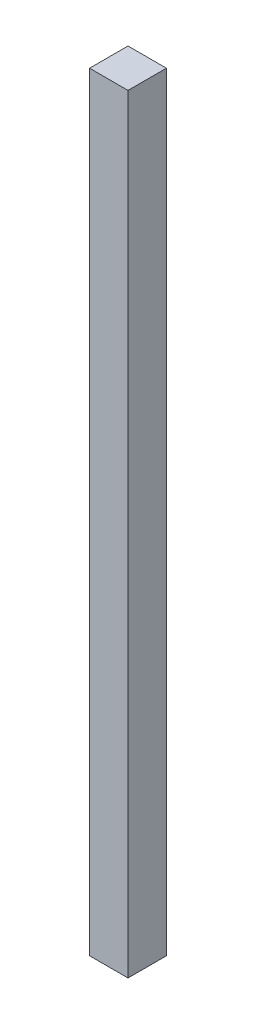
ISO-10303-21;
HEADER;
FILE_DESCRIPTION(('STEP AP214'),'2;1');
FILE_NAME('part.step','',(''),(''),'','','');
FILE_SCHEMA(('AUTOMOTIVE_DESIGN { 1 0 10303 214 1 1 1 1 }'));
ENDSEC;
DATA;
#1=APPLICATION_CONTEXT('core data for automotive mechanical design processes');
#2=APPLICATION_PROTOCOL_DEFINITION('international standard','automotive_design',2000,#1);
#3=PRODUCT_CONTEXT('',#1,'mechanical');
#4=PRODUCT('Part','Part','',(#3));
#5=PRODUCT_RELATED_PRODUCT_CATEGORY('part','',(#4));
#6=PRODUCT_DEFINITION_FORMATION('','',#4);
#7=PRODUCT_DEFINITION_CONTEXT('part definition',#1,'design');
#8=PRODUCT_DEFINITION('design','',#6,#7);
#9=PRODUCT_DEFINITION_SHAPE('','',#8);
#10=(LENGTH_UNIT() NAMED_UNIT(*) SI_UNIT(.MILLI.,.METRE.));
#11=(NAMED_UNIT(*) PLANE_ANGLE_UNIT() SI_UNIT($,.RADIAN.));
#12=(NAMED_UNIT(*) SI_UNIT($,.STERADIAN.) SOLID_ANGLE_UNIT());
#13=UNCERTAINTY_MEASURE_WITH_UNIT(LENGTH_MEASURE(1.E-05),#10,'distance_accuracy_value','');
#14=(GEOMETRIC_REPRESENTATION_CONTEXT(3) GLOBAL_UNCERTAINTY_ASSIGNED_CONTEXT((#13)) GLOBAL_UNIT_ASSIGNED_CONTEXT((#10,
#11,#12)) REPRESENTATION_CONTEXT('',''));
#15=CARTESIAN_POINT('',(0.,0.,0.));
#16=DIRECTION('',(0.,0.,1.));
#17=DIRECTION('',(1.,0.,0.));
#18=AXIS2_PLACEMENT_3D('',#15,#16,#17);
#19=CARTESIAN_POINT('',(0.,508.,0.));
#20=DIRECTION('',(1.,0.,0.));
#21=DIRECTION('',(0.,0.,-1.));
#22=AXIS2_PLACEMENT_3D('',#19,#20,#21);
#23=PLANE('',#22);
#24=DIRECTION('',(0.,0.,1.));
#25=VECTOR('',#24,1.);
#26=CARTESIAN_POINT('',(0.,0.,0.));
#27=LINE('',#26,#25);
#28=CARTESIAN_POINT('',(0.,0.,-25.4000000000001));
#29=VERTEX_POINT('',#28);
#30=CARTESIAN_POINT('',(0.,0.,0.));
#31=VERTEX_POINT('',#30);
#32=EDGE_CURVE('E97',#29,#31,#27,.T.);
#33=ORIENTED_EDGE('',*,*,#32,.T.);
#34=DIRECTION('',(0.,-1.,0.));
#35=VECTOR('',#34,1.);
#36=CARTESIAN_POINT('',(0.,508.,0.));
#37=LINE('',#36,#35);
#38=CARTESIAN_POINT('',(0.,508.,0.));
#39=VERTEX_POINT('',#38);
#40=EDGE_CURVE('E11',#39,#31,#37,.T.);
#41=ORIENTED_EDGE('',*,*,#40,.F.);
#42=DIRECTION('',(0.,0.,1.));
#43=VECTOR('',#42,1.);
#44=CARTESIAN_POINT('',(0.,508.,0.));
#45=LINE('',#44,#43);
#46=CARTESIAN_POINT('',(0.,508.,-25.3999999999999));
#47=VERTEX_POINT('',#46);
#48=EDGE_CURVE('E85',#47,#39,#45,.T.);
#49=ORIENTED_EDGE('',*,*,#48,.F.);
#50=DIRECTION('',(0.,-1.,0.));
#51=VECTOR('',#50,1.);
#52=CARTESIAN_POINT('',(0.,508.,-25.3999999999999));
#53=LINE('',#52,#51);
#54=EDGE_CURVE('E93',#47,#29,#53,.T.);
#55=ORIENTED_EDGE('',*,*,#54,.T.);
#56=EDGE_LOOP('',(#33,#41,#49,#55));
#57=FACE_BOUND('',#56,.T.);
#58=ADVANCED_FACE('F34',(#57),#23,.F.);
#59=CARTESIAN_POINT('',(0.,508.,0.));
#60=DIRECTION('',(0.,0.,-1.));
#61=DIRECTION('',(-1.,0.,0.));
#62=AXIS2_PLACEMENT_3D('',#59,#60,#61);
#63=PLANE('',#62);
#64=DIRECTION('',(1.,0.,0.));
#65=VECTOR('',#64,1.);
#66=CARTESIAN_POINT('',(0.,0.,0.));
#67=LINE('',#66,#65);
#68=CARTESIAN_POINT('',(25.4000000000001,-5.55111512312578E-13,0.));
#69=VERTEX_POINT('',#68);
#70=EDGE_CURVE('E89',#31,#69,#67,.T.);
#71=ORIENTED_EDGE('',*,*,#70,.T.);
#72=DIRECTION('',(0.,-1.,0.));
#73=VECTOR('',#72,1.);
#74=CARTESIAN_POINT('',(25.3999999999999,508.,0.));
#75=LINE('',#74,#73);
#76=CARTESIAN_POINT('',(25.3999999999999,508.,0.));
#77=VERTEX_POINT('',#76);
#78=EDGE_CURVE('E42',#77,#69,#75,.T.);
#79=ORIENTED_EDGE('',*,*,#78,.F.);
#80=DIRECTION('',(1.,0.,0.));
#81=VECTOR('',#80,1.);
#82=CARTESIAN_POINT('',(0.,508.,0.));
#83=LINE('',#82,#81);
#84=EDGE_CURVE('E80',#39,#77,#83,.T.);
#85=ORIENTED_EDGE('',*,*,#84,.F.);
#86=ORIENTED_EDGE('',*,*,#40,.T.);
#87=EDGE_LOOP('',(#71,#79,#85,#86));
#88=FACE_BOUND('',#87,.T.);
#89=ADVANCED_FACE('F88',(#88),#63,.F.);
#90=CARTESIAN_POINT('',(25.3999999999999,508.,0.));
#91=DIRECTION('',(-1.,0.,0.));
#92=DIRECTION('',(0.,0.,1.));
#93=AXIS2_PLACEMENT_3D('',#90,#91,#92);
#94=PLANE('',#93);
#95=DIRECTION('',(0.,0.,-1.));
#96=VECTOR('',#95,1.);
#97=CARTESIAN_POINT('',(25.4000000000001,-5.55111512312578E-13,0.));
#98=LINE('',#97,#96);
#99=CARTESIAN_POINT('',(25.4000000000001,-5.55111512312578E-13,-25.4000000000001));
#100=VERTEX_POINT('',#99);
#101=EDGE_CURVE('E67',#69,#100,#98,.T.);
#102=ORIENTED_EDGE('',*,*,#101,.T.);
#103=DIRECTION('',(0.,-1.,0.));
#104=VECTOR('',#103,1.);
#105=CARTESIAN_POINT('',(25.3999999999999,508.,-25.3999999999999));
#106=LINE('',#105,#104);
#107=CARTESIAN_POINT('',(25.3999999999999,508.,-25.3999999999999));
#108=VERTEX_POINT('',#107);
#109=EDGE_CURVE('E90',#108,#100,#106,.T.);
#110=ORIENTED_EDGE('',*,*,#109,.F.);
#111=DIRECTION('',(0.,0.,-1.));
#112=VECTOR('',#111,1.);
#113=CARTESIAN_POINT('',(25.3999999999999,508.,0.));
#114=LINE('',#113,#112);
#115=EDGE_CURVE('E83',#77,#108,#114,.T.);
#116=ORIENTED_EDGE('',*,*,#115,.F.);
#117=ORIENTED_EDGE('',*,*,#78,.T.);
#118=EDGE_LOOP('',(#102,#110,#116,#117));
#119=FACE_BOUND('',#118,.T.);
#120=ADVANCED_FACE('F91',(#119),#94,.F.);
#121=CARTESIAN_POINT('',(0.,508.,-25.3999999999999));
#122=DIRECTION('',(0.,0.,1.));
#123=DIRECTION('',(1.,0.,0.));
#124=AXIS2_PLACEMENT_3D('',#121,#122,#123);
#125=PLANE('',#124);
#126=DIRECTION('',(-1.,0.,0.));
#127=VECTOR('',#126,1.);
#128=CARTESIAN_POINT('',(0.,0.,-25.4000000000001));
#129=LINE('',#128,#127);
#130=EDGE_CURVE('E73',#100,#29,#129,.T.);
#131=ORIENTED_EDGE('',*,*,#130,.T.);
#132=ORIENTED_EDGE('',*,*,#54,.F.);
#133=DIRECTION('',(-1.,0.,0.));
#134=VECTOR('',#133,1.);
#135=CARTESIAN_POINT('',(0.,508.,-25.3999999999999));
#136=LINE('',#135,#134);
#137=EDGE_CURVE('E50',#108,#47,#136,.T.);
#138=ORIENTED_EDGE('',*,*,#137,.F.);
#139=ORIENTED_EDGE('',*,*,#109,.T.);
#140=EDGE_LOOP('',(#131,#132,#138,#139));
#141=FACE_BOUND('',#140,.T.);
#142=ADVANCED_FACE('F104',(#141),#125,.F.);
#143=CARTESIAN_POINT('',(0.,508.,0.));
#144=DIRECTION('',(0.,-1.,0.));
#145=DIRECTION('',(0.,0.,-1.));
#146=AXIS2_PLACEMENT_3D('',#143,#144,#145);
#147=PLANE('',#146);
#148=ORIENTED_EDGE('',*,*,#48,.T.);
#149=ORIENTED_EDGE('',*,*,#84,.T.);
#150=ORIENTED_EDGE('',*,*,#115,.T.);
#151=ORIENTED_EDGE('',*,*,#137,.T.);
#152=EDGE_LOOP('',(#148,#149,#150,#151));
#153=FACE_BOUND('',#152,.T.);
#154=ADVANCED_FACE('F81',(#153),#147,.F.);
#155=CARTESIAN_POINT('',(0.,0.,0.));
#156=DIRECTION('',(0.,-1.,0.));
#157=DIRECTION('',(0.,0.,-1.));
#158=AXIS2_PLACEMENT_3D('',#155,#156,#157);
#159=PLANE('',#158);
#160=ORIENTED_EDGE('',*,*,#32,.F.);
#161=ORIENTED_EDGE('',*,*,#130,.F.);
#162=ORIENTED_EDGE('',*,*,#101,.F.);
#163=ORIENTED_EDGE('',*,*,#70,.F.);
#164=EDGE_LOOP('',(#160,#161,#162,#163));
#165=FACE_BOUND('',#164,.T.);
#166=ADVANCED_FACE('F107',(#165),#159,.T.);
#167=CLOSED_SHELL('',(#58,#89,#120,#142,#154,#166));
#168=MANIFOLD_SOLID_BREP('B2',#167);
#169=ADVANCED_BREP_SHAPE_REPRESENTATION('',(#18,#168),#14);
#170=SHAPE_DEFINITION_REPRESENTATION(#9,#169);
ENDSEC;
END-ISO-10303-21;
